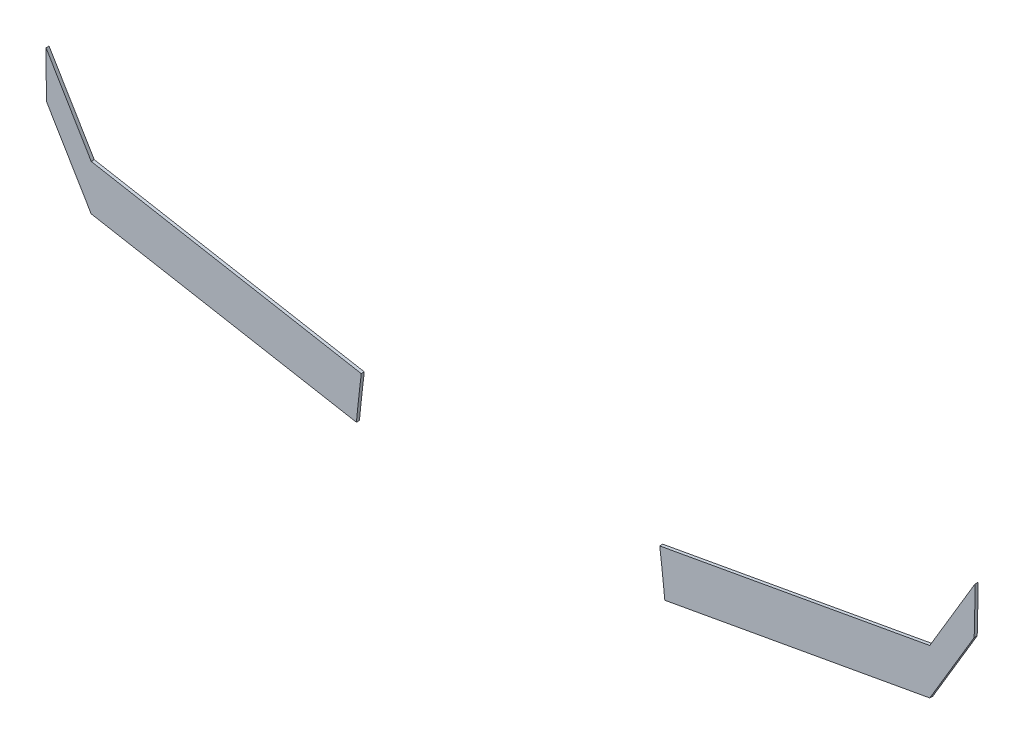
ISO-10303-21;
HEADER;
FILE_DESCRIPTION(('STEP AP214'),'2;1');
FILE_NAME('part.step','',(''),(''),'','','');
FILE_SCHEMA(('AUTOMOTIVE_DESIGN { 1 0 10303 214 1 1 1 1 }'));
ENDSEC;
DATA;
#1=APPLICATION_CONTEXT('core data for automotive mechanical design processes');
#2=APPLICATION_PROTOCOL_DEFINITION('international standard','automotive_design',2000,#1);
#3=PRODUCT_CONTEXT('',#1,'mechanical');
#4=PRODUCT('Part','Part','',(#3));
#5=PRODUCT_RELATED_PRODUCT_CATEGORY('part','',(#4));
#6=PRODUCT_DEFINITION_FORMATION('','',#4);
#7=PRODUCT_DEFINITION_CONTEXT('part definition',#1,'design');
#8=PRODUCT_DEFINITION('design','',#6,#7);
#9=PRODUCT_DEFINITION_SHAPE('','',#8);
#10=(LENGTH_UNIT() NAMED_UNIT(*) SI_UNIT(.MILLI.,.METRE.));
#11=(NAMED_UNIT(*) PLANE_ANGLE_UNIT() SI_UNIT($,.RADIAN.));
#12=(NAMED_UNIT(*) SI_UNIT($,.STERADIAN.) SOLID_ANGLE_UNIT());
#13=UNCERTAINTY_MEASURE_WITH_UNIT(LENGTH_MEASURE(1.E-05),#10,'distance_accuracy_value','');
#14=(GEOMETRIC_REPRESENTATION_CONTEXT(3) GLOBAL_UNCERTAINTY_ASSIGNED_CONTEXT((#13)) GLOBAL_UNIT_ASSIGNED_CONTEXT((#10,
#11,#12)) REPRESENTATION_CONTEXT('',''));
#15=CARTESIAN_POINT('',(0.,0.,0.));
#16=DIRECTION('',(0.,0.,1.));
#17=DIRECTION('',(1.,0.,0.));
#18=AXIS2_PLACEMENT_3D('',#15,#16,#17);
#19=CARTESIAN_POINT('',(-17.419108002327,-31.8093124366713,0.1));
#20=DIRECTION('',(0.,0.,-1.));
#21=DIRECTION('',(-1.,0.,0.));
#22=AXIS2_PLACEMENT_3D('',#19,#20,#21);
#23=CYLINDRICAL_SURFACE('',#22,58.3094921618427);
#24=CARTESIAN_POINT('',(-17.419108002327,-31.8093124366713,0.));
#25=DIRECTION('',(0.,0.,1.));
#26=DIRECTION('',(1.,0.,0.));
#27=AXIS2_PLACEMENT_3D('',#24,#25,#26);
#28=CIRCLE('',#27,58.3094921618427);
#29=CARTESIAN_POINT('',(40.5942494021403,-25.9401354216595,0.));
#30=VERTEX_POINT('',#29);
#31=CARTESIAN_POINT('',(40.4266978339947,-24.4704008471666,0.));
#32=VERTEX_POINT('',#31);
#33=EDGE_CURVE('E123',#30,#32,#28,.T.);
#34=ORIENTED_EDGE('',*,*,#33,.F.);
#35=DIRECTION('',(0.,0.,-1.));
#36=VECTOR('',#35,1.);
#37=CARTESIAN_POINT('',(40.5942494021403,-25.9401354216595,0.1));
#38=LINE('',#37,#36);
#39=CARTESIAN_POINT('',(40.5942494021403,-25.9401354216595,0.1));
#40=VERTEX_POINT('',#39);
#41=EDGE_CURVE('E12',#40,#30,#38,.T.);
#42=ORIENTED_EDGE('',*,*,#41,.F.);
#43=CARTESIAN_POINT('',(-17.419108002327,-31.8093124366713,0.1));
#44=DIRECTION('',(0.,0.,1.));
#45=DIRECTION('',(1.,0.,0.));
#46=AXIS2_PLACEMENT_3D('',#43,#44,#45);
#47=CIRCLE('',#46,58.3094921618427);
#48=CARTESIAN_POINT('',(40.4266978339947,-24.4704008471666,0.1));
#49=VERTEX_POINT('',#48);
#50=EDGE_CURVE('E136',#40,#49,#47,.T.);
#51=ORIENTED_EDGE('',*,*,#50,.T.);
#52=DIRECTION('',(0.,0.,-1.));
#53=VECTOR('',#52,1.);
#54=CARTESIAN_POINT('',(40.4266978339947,-24.4704008471666,0.1));
#55=LINE('',#54,#53);
#56=EDGE_CURVE('E88',#49,#32,#55,.T.);
#57=ORIENTED_EDGE('',*,*,#56,.T.);
#58=EDGE_LOOP('',(#34,#42,#51,#57));
#59=FACE_BOUND('',#58,.T.);
#60=ADVANCED_FACE('F43',(#59),#23,.F.);
#61=CARTESIAN_POINT('',(5.82027846186371,-32.2214793609055,0.1));
#62=DIRECTION('',(0.177756807652185,-0.984074447048242,0.));
#63=DIRECTION('',(0.984074447048243,0.177756807652185,0.));
#64=AXIS2_PLACEMENT_3D('',#61,#62,#63);
#65=PLANE('',#64);
#66=DIRECTION('',(-0.984074447048243,-0.177756807652185,0.));
#67=VECTOR('',#66,1.);
#68=CARTESIAN_POINT('',(5.82027846186371,-32.2214793609055,0.));
#69=LINE('',#68,#67);
#70=CARTESIAN_POINT('',(49.33735519823,-24.3608376561907,0.));
#71=VERTEX_POINT('',#70);
#72=EDGE_CURVE('E126',#71,#30,#69,.T.);
#73=ORIENTED_EDGE('',*,*,#72,.F.);
#74=DIRECTION('',(0.,0.,-1.));
#75=VECTOR('',#74,1.);
#76=CARTESIAN_POINT('',(49.33735519823,-24.3608376561907,0.1));
#77=LINE('',#76,#75);
#78=CARTESIAN_POINT('',(49.33735519823,-24.3608376561907,0.1));
#79=VERTEX_POINT('',#78);
#80=EDGE_CURVE('E51',#79,#71,#77,.T.);
#81=ORIENTED_EDGE('',*,*,#80,.F.);
#82=DIRECTION('',(-0.984074447048243,-0.177756807652185,0.));
#83=VECTOR('',#82,1.);
#84=CARTESIAN_POINT('',(5.82027846186371,-32.2214793609055,0.1));
#85=LINE('',#84,#83);
#86=EDGE_CURVE('E151',#79,#40,#85,.T.);
#87=ORIENTED_EDGE('',*,*,#86,.T.);
#88=ORIENTED_EDGE('',*,*,#41,.T.);
#89=EDGE_LOOP('',(#73,#81,#87,#88));
#90=FACE_BOUND('',#89,.T.);
#91=ADVANCED_FACE('F145',(#90),#65,.T.);
#92=CARTESIAN_POINT('',(47.1178088736658,-28.0845931963196,0.1));
#93=DIRECTION('',(0.858986019994853,-0.511999040480938,0.));
#94=DIRECTION('',(0.511999040480938,0.858986019994853,0.));
#95=AXIS2_PLACEMENT_3D('',#92,#93,#94);
#96=PLANE('',#95);
#97=DIRECTION('',(-0.511999040480938,-0.858986019994853,0.));
#98=VECTOR('',#97,1.);
#99=CARTESIAN_POINT('',(47.1178088736658,-28.0845931963196,0.));
#100=LINE('',#99,#98);
#101=CARTESIAN_POINT('',(50.8016519695572,-21.9041720059735,0.));
#102=VERTEX_POINT('',#101);
#103=EDGE_CURVE('E129',#102,#71,#100,.T.);
#104=ORIENTED_EDGE('',*,*,#103,.F.);
#105=DIRECTION('',(0.,0.,-1.));
#106=VECTOR('',#105,1.);
#107=CARTESIAN_POINT('',(50.8016519695572,-21.9041720059735,0.1));
#108=LINE('',#107,#106);
#109=CARTESIAN_POINT('',(50.8016519695572,-21.9041720059735,0.1));
#110=VERTEX_POINT('',#109);
#111=EDGE_CURVE('E115',#110,#102,#108,.T.);
#112=ORIENTED_EDGE('',*,*,#111,.F.);
#113=DIRECTION('',(-0.511999040480938,-0.858986019994853,0.));
#114=VECTOR('',#113,1.);
#115=CARTESIAN_POINT('',(47.1178088736658,-28.0845931963196,0.1));
#116=LINE('',#115,#114);
#117=EDGE_CURVE('E108',#110,#79,#116,.T.);
#118=ORIENTED_EDGE('',*,*,#117,.T.);
#119=ORIENTED_EDGE('',*,*,#80,.T.);
#120=EDGE_LOOP('',(#104,#112,#118,#119));
#121=FACE_BOUND('',#120,.T.);
#122=ADVANCED_FACE('F142',(#121),#96,.T.);
#123=CARTESIAN_POINT('',(0.761076731048194,-20.2659546895361,0.1));
#124=DIRECTION('',(0.,0.,-1.));
#125=DIRECTION('',(-1.,0.,0.));
#126=AXIS2_PLACEMENT_3D('',#123,#124,#125);
#127=CYLINDRICAL_SURFACE('',#126,50.0673838559272);
#128=CARTESIAN_POINT('',(0.761076731048194,-20.2659546895361,0.));
#129=DIRECTION('',(0.,0.,1.));
#130=DIRECTION('',(1.,0.,0.));
#131=AXIS2_PLACEMENT_3D('',#128,#129,#130);
#132=CIRCLE('',#131,50.0673838559272);
#133=CARTESIAN_POINT('',(50.8283734941844,-20.3593410311611,0.));
#134=VERTEX_POINT('',#133);
#135=EDGE_CURVE('E114',#102,#134,#132,.T.);
#136=ORIENTED_EDGE('',*,*,#135,.T.);
#137=DIRECTION('',(0.,0.,-1.));
#138=VECTOR('',#137,1.);
#139=CARTESIAN_POINT('',(50.8283734941844,-20.3593410311611,0.1));
#140=LINE('',#139,#138);
#141=CARTESIAN_POINT('',(50.8283734941844,-20.3593410311611,0.1));
#142=VERTEX_POINT('',#141);
#143=EDGE_CURVE('E111',#142,#134,#140,.T.);
#144=ORIENTED_EDGE('',*,*,#143,.F.);
#145=CARTESIAN_POINT('',(0.761076731048194,-20.2659546895361,0.1));
#146=DIRECTION('',(0.,0.,1.));
#147=DIRECTION('',(1.,0.,0.));
#148=AXIS2_PLACEMENT_3D('',#145,#146,#147);
#149=CIRCLE('',#148,50.0673838559272);
#150=EDGE_CURVE('E101',#110,#142,#149,.T.);
#151=ORIENTED_EDGE('',*,*,#150,.F.);
#152=ORIENTED_EDGE('',*,*,#111,.T.);
#153=EDGE_LOOP('',(#136,#144,#151,#152));
#154=FACE_BOUND('',#153,.T.);
#155=ADVANCED_FACE('F112',(#154),#127,.T.);
#156=CARTESIAN_POINT('',(46.4581088466299,-27.6913786701395,0.1));
#157=DIRECTION('',(0.858986019994854,-0.511999040480938,0.));
#158=DIRECTION('',(0.511999040480938,0.858986019994854,0.));
#159=AXIS2_PLACEMENT_3D('',#156,#157,#158);
#160=PLANE('',#159);
#161=DIRECTION('',(-0.511999040480938,-0.858986019994854,0.));
#162=VECTOR('',#161,1.);
#163=CARTESIAN_POINT('',(46.4581088466299,-27.6913786701395,0.));
#164=LINE('',#163,#162);
#165=CARTESIAN_POINT('',(49.33735519823,-22.8608376561907,0.));
#166=VERTEX_POINT('',#165);
#167=EDGE_CURVE('E81',#134,#166,#164,.T.);
#168=ORIENTED_EDGE('',*,*,#167,.T.);
#169=DIRECTION('',(0.,0.,-1.));
#170=VECTOR('',#169,1.);
#171=CARTESIAN_POINT('',(49.33735519823,-22.8608376561907,0.1));
#172=LINE('',#171,#170);
#173=CARTESIAN_POINT('',(49.33735519823,-22.8608376561907,0.1));
#174=VERTEX_POINT('',#173);
#175=EDGE_CURVE('E116',#174,#166,#172,.T.);
#176=ORIENTED_EDGE('',*,*,#175,.F.);
#177=DIRECTION('',(-0.511999040480938,-0.858986019994854,0.));
#178=VECTOR('',#177,1.);
#179=CARTESIAN_POINT('',(46.4581088466299,-27.6913786701395,0.1));
#180=LINE('',#179,#178);
#181=EDGE_CURVE('E105',#142,#174,#180,.T.);
#182=ORIENTED_EDGE('',*,*,#181,.F.);
#183=ORIENTED_EDGE('',*,*,#143,.T.);
#184=EDGE_LOOP('',(#168,#176,#182,#183));
#185=FACE_BOUND('',#184,.T.);
#186=ADVANCED_FACE('F118',(#185),#160,.F.);
#187=CARTESIAN_POINT('',(5.55788956356465,-30.7688755849056,0.1));
#188=DIRECTION('',(0.177756807652185,-0.984074447048242,0.));
#189=DIRECTION('',(0.984074447048242,0.177756807652185,0.));
#190=AXIS2_PLACEMENT_3D('',#187,#188,#189);
#191=PLANE('',#190);
#192=DIRECTION('',(-0.984074447048243,-0.177756807652185,0.));
#193=VECTOR('',#192,1.);
#194=CARTESIAN_POINT('',(5.55788956356465,-30.7688755849056,0.));
#195=LINE('',#194,#193);
#196=EDGE_CURVE('E134',#166,#32,#195,.T.);
#197=ORIENTED_EDGE('',*,*,#196,.T.);
#198=ORIENTED_EDGE('',*,*,#56,.F.);
#199=DIRECTION('',(-0.984074447048243,-0.177756807652185,0.));
#200=VECTOR('',#199,1.);
#201=CARTESIAN_POINT('',(5.55788956356465,-30.7688755849056,0.1));
#202=LINE('',#201,#200);
#203=EDGE_CURVE('E59',#174,#49,#202,.T.);
#204=ORIENTED_EDGE('',*,*,#203,.F.);
#205=ORIENTED_EDGE('',*,*,#175,.T.);
#206=EDGE_LOOP('',(#197,#198,#204,#205));
#207=FACE_BOUND('',#206,.T.);
#208=ADVANCED_FACE('F150',(#207),#191,.F.);
#209=CARTESIAN_POINT('',(0.,0.,0.1));
#210=DIRECTION('',(0.,0.,1.));
#211=DIRECTION('',(1.,0.,0.));
#212=AXIS2_PLACEMENT_3D('',#209,#210,#211);
#213=PLANE('',#212);
#214=ORIENTED_EDGE('',*,*,#50,.F.);
#215=ORIENTED_EDGE('',*,*,#86,.F.);
#216=ORIENTED_EDGE('',*,*,#117,.F.);
#217=ORIENTED_EDGE('',*,*,#150,.T.);
#218=ORIENTED_EDGE('',*,*,#181,.T.);
#219=ORIENTED_EDGE('',*,*,#203,.T.);
#220=EDGE_LOOP('',(#214,#215,#216,#217,#218,#219));
#221=FACE_BOUND('',#220,.T.);
#222=ADVANCED_FACE('F103',(#221),#213,.T.);
#223=CARTESIAN_POINT('',(0.,0.,0.));
#224=DIRECTION('',(0.,0.,1.));
#225=DIRECTION('',(1.,0.,0.));
#226=AXIS2_PLACEMENT_3D('',#223,#224,#225);
#227=PLANE('',#226);
#228=ORIENTED_EDGE('',*,*,#33,.T.);
#229=ORIENTED_EDGE('',*,*,#196,.F.);
#230=ORIENTED_EDGE('',*,*,#167,.F.);
#231=ORIENTED_EDGE('',*,*,#135,.F.);
#232=ORIENTED_EDGE('',*,*,#103,.T.);
#233=ORIENTED_EDGE('',*,*,#72,.T.);
#234=EDGE_LOOP('',(#228,#229,#230,#231,#232,#233));
#235=FACE_BOUND('',#234,.T.);
#236=ADVANCED_FACE('F147',(#235),#227,.F.);
#237=CLOSED_SHELL('',(#60,#91,#122,#155,#186,#208,#222,#236));
#238=MANIFOLD_SOLID_BREP('B2',#237);
#239=CARTESIAN_POINT('',(83.6478101465728,-30.9788960064752,0.1));
#240=DIRECTION('',(0.,0.,-1.));
#241=DIRECTION('',(-1.,0.,0.));
#242=AXIS2_PLACEMENT_3D('',#239,#240,#241);
#243=CYLINDRICAL_SURFACE('',#242,53.4669967548037);
#244=CARTESIAN_POINT('',(83.6478101465728,-30.9788960064752,0.));
#245=DIRECTION('',(0.,0.,1.));
#246=DIRECTION('',(1.,0.,0.));
#247=AXIS2_PLACEMENT_3D('',#244,#245,#246);
#248=CIRCLE('',#247,53.4669967548037);
#249=CARTESIAN_POINT('',(30.5783404619262,-24.4711214737666,0.));
#250=VERTEX_POINT('',#249);
#251=CARTESIAN_POINT('',(30.418644104399,-25.9414736067863,0.));
#252=VERTEX_POINT('',#251);
#253=EDGE_CURVE('E299',#250,#252,#248,.T.);
#254=ORIENTED_EDGE('',*,*,#253,.F.);
#255=DIRECTION('',(0.,0.,-1.));
#256=VECTOR('',#255,1.);
#257=CARTESIAN_POINT('',(30.5783404619262,-24.4711214737666,0.1));
#258=LINE('',#257,#256);
#259=CARTESIAN_POINT('',(30.5783404619262,-24.4711214737666,0.1));
#260=VERTEX_POINT('',#259);
#261=EDGE_CURVE('E41',#260,#250,#258,.T.);
#262=ORIENTED_EDGE('',*,*,#261,.F.);
#263=CARTESIAN_POINT('',(83.6478101465728,-30.9788960064752,0.1));
#264=DIRECTION('',(0.,0.,1.));
#265=DIRECTION('',(1.,0.,0.));
#266=AXIS2_PLACEMENT_3D('',#263,#264,#265);
#267=CIRCLE('',#266,53.4669967548037);
#268=CARTESIAN_POINT('',(30.418644104399,-25.9414736067863,0.1));
#269=VERTEX_POINT('',#268);
#270=EDGE_CURVE('E312',#260,#269,#267,.T.);
#271=ORIENTED_EDGE('',*,*,#270,.T.);
#272=DIRECTION('',(0.,0.,-1.));
#273=VECTOR('',#272,1.);
#274=CARTESIAN_POINT('',(30.418644104399,-25.9414736067863,0.1));
#275=LINE('',#274,#273);
#276=EDGE_CURVE('E264',#269,#252,#275,.T.);
#277=ORIENTED_EDGE('',*,*,#276,.T.);
#278=EDGE_LOOP('',(#254,#262,#271,#277));
#279=FACE_BOUND('',#278,.T.);
#280=ADVANCED_FACE('F219',(#279),#243,.F.);
#281=CARTESIAN_POINT('',(-3.31264503382373,-18.3543957364622,0.1));
#282=DIRECTION('',(0.177612791840136,0.984100450246189,0.));
#283=DIRECTION('',(-0.984100450246189,0.177612791840136,0.));
#284=AXIS2_PLACEMENT_3D('',#281,#282,#283);
#285=PLANE('',#284);
#286=DIRECTION('',(0.984100450246189,-0.177612791840136,0.));
#287=VECTOR('',#286,1.);
#288=CARTESIAN_POINT('',(-3.31264503382373,-18.3543957364622,0.));
#289=LINE('',#288,#287);
#290=CARTESIAN_POINT('',(21.6674476423472,-22.8628623259553,0.));
#291=VERTEX_POINT('',#290);
#292=EDGE_CURVE('E302',#291,#250,#289,.T.);
#293=ORIENTED_EDGE('',*,*,#292,.F.);
#294=DIRECTION('',(0.,0.,-1.));
#295=VECTOR('',#294,1.);
#296=CARTESIAN_POINT('',(21.6674476423472,-22.8628623259553,0.1));
#297=LINE('',#296,#295);
#298=CARTESIAN_POINT('',(21.6674476423472,-22.8628623259553,0.1));
#299=VERTEX_POINT('',#298);
#300=EDGE_CURVE('E227',#299,#291,#297,.T.);
#301=ORIENTED_EDGE('',*,*,#300,.F.);
#302=DIRECTION('',(0.984100450246189,-0.177612791840136,0.));
#303=VECTOR('',#302,1.);
#304=CARTESIAN_POINT('',(-3.31264503382373,-18.3543957364622,0.1));
#305=LINE('',#304,#303);
#306=EDGE_CURVE('E327',#299,#260,#305,.T.);
#307=ORIENTED_EDGE('',*,*,#306,.T.);
#308=ORIENTED_EDGE('',*,*,#261,.T.);
#309=EDGE_LOOP('',(#293,#301,#307,#308));
#310=FACE_BOUND('',#309,.T.);
#311=ADVANCED_FACE('F321',(#310),#285,.T.);
#312=CARTESIAN_POINT('',(5.92800967937003,3.53456893812716,0.1));
#313=DIRECTION('',(0.858911082539597,0.512124742900261,0.));
#314=DIRECTION('',(-0.512124742900261,0.858911082539597,0.));
#315=AXIS2_PLACEMENT_3D('',#312,#313,#314);
#316=PLANE('',#315);
#317=DIRECTION('',(0.512124742900261,-0.858911082539597,0.));
#318=VECTOR('',#317,1.);
#319=CARTESIAN_POINT('',(5.92800967937003,3.53456893812716,0.));
#320=LINE('',#319,#318);
#321=CARTESIAN_POINT('',(20.176063282021,-20.3615839300785,0.));
#322=VERTEX_POINT('',#321);
#323=EDGE_CURVE('E305',#322,#291,#320,.T.);
#324=ORIENTED_EDGE('',*,*,#323,.F.);
#325=DIRECTION('',(0.,0.,-1.));
#326=VECTOR('',#325,1.);
#327=CARTESIAN_POINT('',(20.176063282021,-20.3615839300785,0.1));
#328=LINE('',#327,#326);
#329=CARTESIAN_POINT('',(20.176063282021,-20.3615839300785,0.1));
#330=VERTEX_POINT('',#329);
#331=EDGE_CURVE('E291',#330,#322,#328,.T.);
#332=ORIENTED_EDGE('',*,*,#331,.F.);
#333=DIRECTION('',(0.512124742900261,-0.858911082539597,0.));
#334=VECTOR('',#333,1.);
#335=CARTESIAN_POINT('',(5.92800967937003,3.53456893812716,0.1));
#336=LINE('',#335,#334);
#337=EDGE_CURVE('E284',#330,#299,#336,.T.);
#338=ORIENTED_EDGE('',*,*,#337,.T.);
#339=ORIENTED_EDGE('',*,*,#300,.T.);
#340=EDGE_LOOP('',(#324,#332,#338,#339));
#341=FACE_BOUND('',#340,.T.);
#342=ADVANCED_FACE('F318',(#341),#316,.T.);
#343=CARTESIAN_POINT('',(74.3248582749269,-20.3684277007862,0.1));
#344=DIRECTION('',(0.,0.,-1.));
#345=DIRECTION('',(-1.,0.,0.));
#346=AXIS2_PLACEMENT_3D('',#343,#344,#345);
#347=CYLINDRICAL_SURFACE('',#346,54.148795425392);
#348=CARTESIAN_POINT('',(74.3248582749269,-20.3684277007862,0.));
#349=DIRECTION('',(0.,0.,1.));
#350=DIRECTION('',(1.,0.,0.));
#351=AXIS2_PLACEMENT_3D('',#348,#349,#350);
#352=CIRCLE('',#351,54.148795425392);
#353=CARTESIAN_POINT('',(20.1976906775399,-21.8987132641132,0.));
#354=VERTEX_POINT('',#353);
#355=EDGE_CURVE('E290',#322,#354,#352,.T.);
#356=ORIENTED_EDGE('',*,*,#355,.T.);
#357=DIRECTION('',(0.,0.,-1.));
#358=VECTOR('',#357,1.);
#359=CARTESIAN_POINT('',(20.1976906775399,-21.8987132641132,0.1));
#360=LINE('',#359,#358);
#361=CARTESIAN_POINT('',(20.1976906775399,-21.8987132641132,0.1));
#362=VERTEX_POINT('',#361);
#363=EDGE_CURVE('E287',#362,#354,#360,.T.);
#364=ORIENTED_EDGE('',*,*,#363,.F.);
#365=CARTESIAN_POINT('',(74.3248582749269,-20.3684277007862,0.1));
#366=DIRECTION('',(0.,0.,1.));
#367=DIRECTION('',(1.,0.,0.));
#368=AXIS2_PLACEMENT_3D('',#365,#366,#367);
#369=CIRCLE('',#368,54.148795425392);
#370=EDGE_CURVE('E277',#330,#362,#369,.T.);
#371=ORIENTED_EDGE('',*,*,#370,.F.);
#372=ORIENTED_EDGE('',*,*,#331,.T.);
#373=EDGE_LOOP('',(#356,#364,#371,#372));
#374=FACE_BOUND('',#373,.T.);
#375=ADVANCED_FACE('F288',(#374),#347,.T.);
#376=CARTESIAN_POINT('',(5.26927555452791,3.14143268336124,0.1));
#377=DIRECTION('',(0.858937381336881,0.512080633242599,0.));
#378=DIRECTION('',(-0.512080633242599,0.858937381336881,0.));
#379=AXIS2_PLACEMENT_3D('',#376,#377,#378);
#380=PLANE('',#379);
#381=DIRECTION('',(0.512080633242599,-0.858937381336881,0.));
#382=VECTOR('',#381,1.);
#383=CARTESIAN_POINT('',(5.26927555452791,3.14143268336124,0.));
#384=LINE('',#383,#382);
#385=CARTESIAN_POINT('',(21.6663416401417,-24.3621518908138,0.));
#386=VERTEX_POINT('',#385);
#387=EDGE_CURVE('E257',#354,#386,#384,.T.);
#388=ORIENTED_EDGE('',*,*,#387,.T.);
#389=DIRECTION('',(0.,0.,-1.));
#390=VECTOR('',#389,1.);
#391=CARTESIAN_POINT('',(21.6663416401417,-24.3621518908138,0.1));
#392=LINE('',#391,#390);
#393=CARTESIAN_POINT('',(21.6663416401417,-24.3621518908138,0.1));
#394=VERTEX_POINT('',#393);
#395=EDGE_CURVE('E292',#394,#386,#392,.T.);
#396=ORIENTED_EDGE('',*,*,#395,.F.);
#397=DIRECTION('',(0.512080633242599,-0.858937381336881,0.));
#398=VECTOR('',#397,1.);
#399=CARTESIAN_POINT('',(5.26927555452791,3.14143268336124,0.1));
#400=LINE('',#399,#398);
#401=EDGE_CURVE('E281',#362,#394,#400,.T.);
#402=ORIENTED_EDGE('',*,*,#401,.F.);
#403=ORIENTED_EDGE('',*,*,#363,.T.);
#404=EDGE_LOOP('',(#388,#396,#402,#403));
#405=FACE_BOUND('',#404,.T.);
#406=ADVANCED_FACE('F294',(#405),#380,.F.);
#407=CARTESIAN_POINT('',(-3.57420793783663,-19.80758488009,0.1));
#408=DIRECTION('',(0.177578526798536,0.984106633866504,0.));
#409=DIRECTION('',(-0.984106633866504,0.177578526798536,0.));
#410=AXIS2_PLACEMENT_3D('',#407,#408,#409);
#411=PLANE('',#410);
#412=DIRECTION('',(0.984106633866504,-0.177578526798536,0.));
#413=VECTOR('',#412,1.);
#414=CARTESIAN_POINT('',(-3.57420793783663,-19.80758488009,0.));
#415=LINE('',#414,#413);
#416=EDGE_CURVE('E310',#386,#252,#415,.T.);
#417=ORIENTED_EDGE('',*,*,#416,.T.);
#418=ORIENTED_EDGE('',*,*,#276,.F.);
#419=DIRECTION('',(0.984106633866504,-0.177578526798536,0.));
#420=VECTOR('',#419,1.);
#421=CARTESIAN_POINT('',(-3.57420793783663,-19.80758488009,0.1));
#422=LINE('',#421,#420);
#423=EDGE_CURVE('E235',#394,#269,#422,.T.);
#424=ORIENTED_EDGE('',*,*,#423,.F.);
#425=ORIENTED_EDGE('',*,*,#395,.T.);
#426=EDGE_LOOP('',(#417,#418,#424,#425));
#427=FACE_BOUND('',#426,.T.);
#428=ADVANCED_FACE('F326',(#427),#411,.F.);
#429=CARTESIAN_POINT('',(0.,0.,0.1));
#430=DIRECTION('',(0.,0.,1.));
#431=DIRECTION('',(1.,0.,0.));
#432=AXIS2_PLACEMENT_3D('',#429,#430,#431);
#433=PLANE('',#432);
#434=ORIENTED_EDGE('',*,*,#270,.F.);
#435=ORIENTED_EDGE('',*,*,#306,.F.);
#436=ORIENTED_EDGE('',*,*,#337,.F.);
#437=ORIENTED_EDGE('',*,*,#370,.T.);
#438=ORIENTED_EDGE('',*,*,#401,.T.);
#439=ORIENTED_EDGE('',*,*,#423,.T.);
#440=EDGE_LOOP('',(#434,#435,#436,#437,#438,#439));
#441=FACE_BOUND('',#440,.T.);
#442=ADVANCED_FACE('F279',(#441),#433,.T.);
#443=CARTESIAN_POINT('',(0.,0.,0.));
#444=DIRECTION('',(0.,0.,1.));
#445=DIRECTION('',(1.,0.,0.));
#446=AXIS2_PLACEMENT_3D('',#443,#444,#445);
#447=PLANE('',#446);
#448=ORIENTED_EDGE('',*,*,#253,.T.);
#449=ORIENTED_EDGE('',*,*,#416,.F.);
#450=ORIENTED_EDGE('',*,*,#387,.F.);
#451=ORIENTED_EDGE('',*,*,#355,.F.);
#452=ORIENTED_EDGE('',*,*,#323,.T.);
#453=ORIENTED_EDGE('',*,*,#292,.T.);
#454=EDGE_LOOP('',(#448,#449,#450,#451,#452,#453));
#455=FACE_BOUND('',#454,.T.);
#456=ADVANCED_FACE('F323',(#455),#447,.F.);
#457=CLOSED_SHELL('',(#280,#311,#342,#375,#406,#428,#442,#456));
#458=MANIFOLD_SOLID_BREP('B6',#457);
#459=ADVANCED_BREP_SHAPE_REPRESENTATION('',(#18,#238,#458),#14);
#460=SHAPE_DEFINITION_REPRESENTATION(#9,#459);
ENDSEC;
END-ISO-10303-21;
